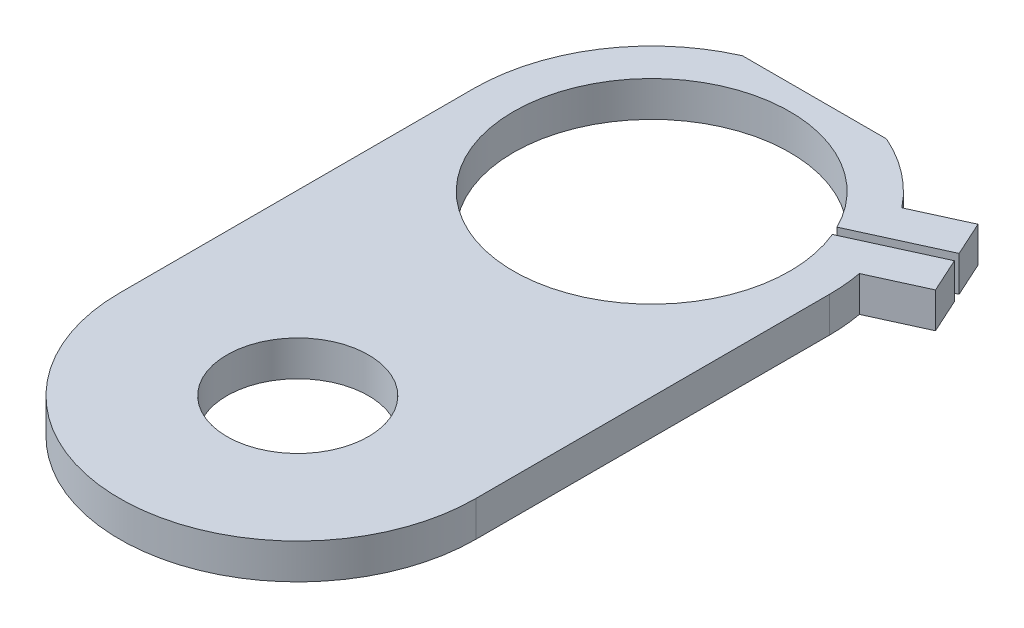
ISO-10303-21;
HEADER;
FILE_DESCRIPTION(('STEP AP214'),'2;1');
FILE_NAME('part.step','',(''),(''),'','','');
FILE_SCHEMA(('AUTOMOTIVE_DESIGN { 1 0 10303 214 1 1 1 1 }'));
ENDSEC;
DATA;
#1=APPLICATION_CONTEXT('core data for automotive mechanical design processes');
#2=APPLICATION_PROTOCOL_DEFINITION('international standard','automotive_design',2000,#1);
#3=PRODUCT_CONTEXT('',#1,'mechanical');
#4=PRODUCT('Part','Part','',(#3));
#5=PRODUCT_RELATED_PRODUCT_CATEGORY('part','',(#4));
#6=PRODUCT_DEFINITION_FORMATION('','',#4);
#7=PRODUCT_DEFINITION_CONTEXT('part definition',#1,'design');
#8=PRODUCT_DEFINITION('design','',#6,#7);
#9=PRODUCT_DEFINITION_SHAPE('','',#8);
#10=(LENGTH_UNIT() NAMED_UNIT(*) SI_UNIT(.MILLI.,.METRE.));
#11=(NAMED_UNIT(*) PLANE_ANGLE_UNIT() SI_UNIT($,.RADIAN.));
#12=(NAMED_UNIT(*) SI_UNIT($,.STERADIAN.) SOLID_ANGLE_UNIT());
#13=UNCERTAINTY_MEASURE_WITH_UNIT(LENGTH_MEASURE(1.E-05),#10,'distance_accuracy_value','');
#14=(GEOMETRIC_REPRESENTATION_CONTEXT(3) GLOBAL_UNCERTAINTY_ASSIGNED_CONTEXT((#13)) GLOBAL_UNIT_ASSIGNED_CONTEXT((#10,
#11,#12)) REPRESENTATION_CONTEXT('',''));
#15=CARTESIAN_POINT('',(0.,0.,0.));
#16=DIRECTION('',(0.,0.,1.));
#17=DIRECTION('',(1.,0.,0.));
#18=AXIS2_PLACEMENT_3D('',#15,#16,#17);
#19=CARTESIAN_POINT('',(0.,0.,0.));
#20=DIRECTION('',(0.,1.,0.));
#21=DIRECTION('',(0.,0.,1.));
#22=AXIS2_PLACEMENT_3D('',#19,#20,#21);
#23=PLANE('',#22);
#24=CARTESIAN_POINT('',(-44.45,0.,41.3113329753969));
#25=DIRECTION('',(0.,1.,0.));
#26=DIRECTION('',(0.,0.,1.));
#27=AXIS2_PLACEMENT_3D('',#24,#25,#26);
#28=CIRCLE('',#27,3.175);
#29=CARTESIAN_POINT('',(-44.45,0.,44.4863329753969));
#30=VERTEX_POINT('',#29);
#31=EDGE_CURVE('E322',#30,#30,#28,.T.);
#32=ORIENTED_EDGE('',*,*,#31,.T.);
#33=EDGE_LOOP('',(#32));
#34=FACE_BOUND('',#33,.T.);
#35=CARTESIAN_POINT('',(-44.45,0.,127.));
#36=DIRECTION('',(0.,1.,0.));
#37=DIRECTION('',(0.,0.,1.));
#38=AXIS2_PLACEMENT_3D('',#35,#36,#37);
#39=CIRCLE('',#38,3.175);
#40=CARTESIAN_POINT('',(-44.45,0.,130.175));
#41=VERTEX_POINT('',#40);
#42=EDGE_CURVE('E303',#41,#41,#39,.T.);
#43=ORIENTED_EDGE('',*,*,#42,.T.);
#44=EDGE_LOOP('',(#43));
#45=FACE_BOUND('',#44,.T.);
#46=CARTESIAN_POINT('',(44.45,0.,127.));
#47=DIRECTION('',(0.,1.,0.));
#48=DIRECTION('',(0.,0.,1.));
#49=AXIS2_PLACEMENT_3D('',#46,#47,#48);
#50=CIRCLE('',#49,3.175);
#51=CARTESIAN_POINT('',(44.45,0.,130.175));
#52=VERTEX_POINT('',#51);
#53=EDGE_CURVE('E314',#52,#52,#50,.T.);
#54=ORIENTED_EDGE('',*,*,#53,.T.);
#55=EDGE_LOOP('',(#54));
#56=FACE_BOUND('',#55,.T.);
#57=CARTESIAN_POINT('',(0.,0.,127.));
#58=DIRECTION('',(0.,1.,0.));
#59=DIRECTION('',(0.,0.,1.));
#60=AXIS2_PLACEMENT_3D('',#57,#58,#59);
#61=CIRCLE('',#60,25.4);
#62=CARTESIAN_POINT('',(0.,0.,152.4));
#63=VERTEX_POINT('',#62);
#64=EDGE_CURVE('E298',#63,#63,#61,.T.);
#65=ORIENTED_EDGE('',*,*,#64,.T.);
#66=EDGE_LOOP('',(#65));
#67=FACE_BOUND('',#66,.T.);
#68=CARTESIAN_POINT('',(0.,0.,0.));
#69=DIRECTION('',(0.,1.,0.));
#70=DIRECTION('',(0.,0.,1.));
#71=AXIS2_PLACEMENT_3D('',#68,#69,#70);
#72=CIRCLE('',#71,49.5875364217784);
#73=CARTESIAN_POINT('',(44.3704280468253,0.,-22.1402096494749));
#74=VERTEX_POINT('',#73);
#75=CARTESIAN_POINT('',(45.7963528226343,0.,-19.0162519053045));
#76=VERTEX_POINT('',#75);
#77=EDGE_CURVE('E52',#74,#76,#72,.T.);
#78=ORIENTED_EDGE('',*,*,#77,.T.);
#79=DIRECTION('',(-0.909713288386591,0.,0.415236959979306));
#80=VECTOR('',#79,1.);
#81=CARTESIAN_POINT('',(75.8713050969462,0.,-32.7439086443375));
#82=LINE('',#81,#80);
#83=CARTESIAN_POINT('',(75.8713050969462,0.,-32.7439086443375));
#84=VERTEX_POINT('',#83);
#85=EDGE_CURVE('E187',#84,#76,#82,.T.);
#86=ORIENTED_EDGE('',*,*,#85,.F.);
#87=DIRECTION('',(-0.415236959979306,0.,-0.90971328838659));
#88=VECTOR('',#87,1.);
#89=CARTESIAN_POINT('',(81.5560801827155,0.,-20.2895369591411));
#90=LINE('',#89,#88);
#91=CARTESIAN_POINT('',(81.5560801827155,0.,-20.2895369591411));
#92=VERTEX_POINT('',#91);
#93=EDGE_CURVE('E184',#92,#84,#90,.T.);
#94=ORIENTED_EDGE('',*,*,#93,.F.);
#95=DIRECTION('',(0.90971328838659,0.,-0.415236959979306));
#96=VECTOR('',#95,1.);
#97=CARTESIAN_POINT('',(62.7955082286804,0.,-11.7263083407238));
#98=LINE('',#97,#96);
#99=CARTESIAN_POINT('',(62.7955082286804,0.,-11.7263083407238));
#100=VERTEX_POINT('',#99);
#101=EDGE_CURVE('E180',#100,#92,#98,.T.);
#102=ORIENTED_EDGE('',*,*,#101,.F.);
#103=CARTESIAN_POINT('',(0.,0.,0.));
#104=DIRECTION('',(0.,1.,0.));
#105=DIRECTION('',(0.,0.,1.));
#106=AXIS2_PLACEMENT_3D('',#103,#104,#105);
#107=CIRCLE('',#106,63.881);
#108=CARTESIAN_POINT('',(63.881,0.,0.));
#109=VERTEX_POINT('',#108);
#110=EDGE_CURVE('E176',#109,#100,#107,.T.);
#111=ORIENTED_EDGE('',*,*,#110,.F.);
#112=DIRECTION('',(0.,0.,-1.));
#113=VECTOR('',#112,1.);
#114=CARTESIAN_POINT('',(63.881,0.,0.));
#115=LINE('',#114,#113);
#116=CARTESIAN_POINT('',(63.881,0.,127.));
#117=VERTEX_POINT('',#116);
#118=EDGE_CURVE('E106',#117,#109,#115,.T.);
#119=ORIENTED_EDGE('',*,*,#118,.F.);
#120=CARTESIAN_POINT('',(0.,0.,127.));
#121=DIRECTION('',(0.,1.,0.));
#122=DIRECTION('',(0.,0.,1.));
#123=AXIS2_PLACEMENT_3D('',#120,#121,#122);
#124=CIRCLE('',#123,63.881);
#125=CARTESIAN_POINT('',(-63.881,0.,127.));
#126=VERTEX_POINT('',#125);
#127=EDGE_CURVE('E212',#126,#117,#124,.T.);
#128=ORIENTED_EDGE('',*,*,#127,.F.);
#129=DIRECTION('',(0.,0.,1.));
#130=VECTOR('',#129,1.);
#131=CARTESIAN_POINT('',(-63.881,0.,0.));
#132=LINE('',#131,#130);
#133=CARTESIAN_POINT('',(-63.881,0.,0.));
#134=VERTEX_POINT('',#133);
#135=EDGE_CURVE('E160',#134,#126,#132,.T.);
#136=ORIENTED_EDGE('',*,*,#135,.F.);
#137=CARTESIAN_POINT('',(0.,0.,0.));
#138=DIRECTION('',(0.,1.,0.));
#139=DIRECTION('',(0.,0.,1.));
#140=AXIS2_PLACEMENT_3D('',#137,#138,#139);
#141=CIRCLE('',#140,63.881);
#142=CARTESIAN_POINT('',(-25.8434858523381,0.,-58.42));
#143=VERTEX_POINT('',#142);
#144=EDGE_CURVE('E207',#143,#134,#141,.T.);
#145=ORIENTED_EDGE('',*,*,#144,.F.);
#146=DIRECTION('',(-1.,0.,0.));
#147=VECTOR('',#146,1.);
#148=CARTESIAN_POINT('',(0.,0.,-58.42));
#149=LINE('',#148,#147);
#150=CARTESIAN_POINT('',(25.8434858523381,0.,-58.42));
#151=VERTEX_POINT('',#150);
#152=EDGE_CURVE('E204',#151,#143,#149,.T.);
#153=ORIENTED_EDGE('',*,*,#152,.F.);
#154=CARTESIAN_POINT('',(0.,0.,0.));
#155=DIRECTION('',(0.,1.,0.));
#156=DIRECTION('',(0.,0.,1.));
#157=AXIS2_PLACEMENT_3D('',#154,#155,#156);
#158=CIRCLE('',#157,63.881);
#159=CARTESIAN_POINT('',(50.000033281333,0.,-39.7590094552869));
#160=VERTEX_POINT('',#159);
#161=EDGE_CURVE('E200',#160,#151,#158,.T.);
#162=ORIENTED_EDGE('',*,*,#161,.F.);
#163=DIRECTION('',(-0.909713288386591,0.,0.415236959979306));
#164=VECTOR('',#163,1.);
#165=CARTESIAN_POINT('',(50.000033281333,0.,-39.7590094552869));
#166=LINE('',#165,#164);
#167=CARTESIAN_POINT('',(68.760605235368,0.,-48.3222380737042));
#168=VERTEX_POINT('',#167);
#169=EDGE_CURVE('E197',#168,#160,#166,.T.);
#170=ORIENTED_EDGE('',*,*,#169,.F.);
#171=DIRECTION('',(-0.415236959979306,0.,-0.909713288386591));
#172=VECTOR('',#171,1.);
#173=CARTESIAN_POINT('',(74.4453803211373,0.,-35.8678663885078));
#174=LINE('',#173,#172);
#175=CARTESIAN_POINT('',(74.4453803211373,0.,-35.8678663885078));
#176=VERTEX_POINT('',#175);
#177=EDGE_CURVE('E194',#176,#168,#174,.T.);
#178=ORIENTED_EDGE('',*,*,#177,.F.);
#179=DIRECTION('',(0.909713288386591,0.,-0.415236959979306));
#180=VECTOR('',#179,1.);
#181=CARTESIAN_POINT('',(74.4453803211373,0.,-35.8678663885078));
#182=LINE('',#181,#180);
#183=EDGE_CURVE('E191',#74,#176,#182,.T.);
#184=ORIENTED_EDGE('',*,*,#183,.F.);
#185=EDGE_LOOP('',(#78,#86,#94,#102,#111,#119,#128,#136,#145,#153,#162,#170,#178,#184));
#186=FACE_BOUND('',#185,.T.);
#187=CARTESIAN_POINT('',(0.,0.,171.45));
#188=DIRECTION('',(0.,1.,0.));
#189=DIRECTION('',(0.,0.,1.));
#190=AXIS2_PLACEMENT_3D('',#187,#188,#189);
#191=CIRCLE('',#190,3.17500000000001);
#192=CARTESIAN_POINT('',(0.,0.,174.625));
#193=VERTEX_POINT('',#192);
#194=EDGE_CURVE('E311',#193,#193,#191,.T.);
#195=ORIENTED_EDGE('',*,*,#194,.T.);
#196=EDGE_LOOP('',(#195));
#197=FACE_BOUND('',#196,.T.);
#198=CARTESIAN_POINT('',(0.,0.,82.55));
#199=DIRECTION('',(0.,1.,0.));
#200=DIRECTION('',(0.,0.,1.));
#201=AXIS2_PLACEMENT_3D('',#198,#199,#200);
#202=CIRCLE('',#201,3.175);
#203=CARTESIAN_POINT('',(0.,0.,85.725));
#204=VERTEX_POINT('',#203);
#205=EDGE_CURVE('E304',#204,#204,#202,.T.);
#206=ORIENTED_EDGE('',*,*,#205,.T.);
#207=EDGE_LOOP('',(#206));
#208=FACE_BOUND('',#207,.T.);
#209=CARTESIAN_POINT('',(44.45,0.,45.3064469575111));
#210=DIRECTION('',(0.,1.,0.));
#211=DIRECTION('',(0.,0.,1.));
#212=AXIS2_PLACEMENT_3D('',#209,#210,#211);
#213=CIRCLE('',#212,3.175);
#214=CARTESIAN_POINT('',(44.45,0.,48.4814469575111));
#215=VERTEX_POINT('',#214);
#216=EDGE_CURVE('E323',#215,#215,#213,.T.);
#217=ORIENTED_EDGE('',*,*,#216,.T.);
#218=EDGE_LOOP('',(#217));
#219=FACE_BOUND('',#218,.T.);
#220=ADVANCED_FACE('F37',(#34,#45,#56,#67,#186,#197,#208,#219),#23,.F.);
#221=CARTESIAN_POINT('',(0.,12.7,0.));
#222=DIRECTION('',(0.,1.,0.));
#223=DIRECTION('',(0.,0.,1.));
#224=AXIS2_PLACEMENT_3D('',#221,#222,#223);
#225=PLANE('',#224);
#226=CARTESIAN_POINT('',(0.,12.7,127.));
#227=DIRECTION('',(0.,1.,0.));
#228=DIRECTION('',(0.,0.,1.));
#229=AXIS2_PLACEMENT_3D('',#226,#227,#228);
#230=CIRCLE('',#229,25.4);
#231=CARTESIAN_POINT('',(0.,12.7,152.4));
#232=VERTEX_POINT('',#231);
#233=EDGE_CURVE('E181',#232,#232,#230,.T.);
#234=ORIENTED_EDGE('',*,*,#233,.F.);
#235=EDGE_LOOP('',(#234));
#236=FACE_BOUND('',#235,.T.);
#237=DIRECTION('',(-0.909713288386591,0.,0.415236959979306));
#238=VECTOR('',#237,1.);
#239=CARTESIAN_POINT('',(75.8713050969462,12.7,-32.7439086443375));
#240=LINE('',#239,#238);
#241=CARTESIAN_POINT('',(75.8713050969462,12.7,-32.7439086443375));
#242=VERTEX_POINT('',#241);
#243=CARTESIAN_POINT('',(45.7963528226343,12.7,-19.0162519053045));
#244=VERTEX_POINT('',#243);
#245=EDGE_CURVE('E270',#242,#244,#240,.T.);
#246=ORIENTED_EDGE('',*,*,#245,.T.);
#247=CARTESIAN_POINT('',(0.,12.7,0.));
#248=DIRECTION('',(0.,1.,0.));
#249=DIRECTION('',(0.,0.,1.));
#250=AXIS2_PLACEMENT_3D('',#247,#248,#249);
#251=CIRCLE('',#250,49.5875364217784);
#252=CARTESIAN_POINT('',(44.3704280468253,12.7,-22.1402096494749));
#253=VERTEX_POINT('',#252);
#254=EDGE_CURVE('E326',#253,#244,#251,.T.);
#255=ORIENTED_EDGE('',*,*,#254,.F.);
#256=DIRECTION('',(0.909713288386591,0.,-0.415236959979306));
#257=VECTOR('',#256,1.);
#258=CARTESIAN_POINT('',(74.4453803211373,12.7,-35.8678663885078));
#259=LINE('',#258,#257);
#260=CARTESIAN_POINT('',(74.4453803211373,12.7,-35.8678663885078));
#261=VERTEX_POINT('',#260);
#262=EDGE_CURVE('E275',#253,#261,#259,.T.);
#263=ORIENTED_EDGE('',*,*,#262,.T.);
#264=DIRECTION('',(-0.415236959979306,0.,-0.909713288386591));
#265=VECTOR('',#264,1.);
#266=CARTESIAN_POINT('',(74.4453803211373,12.7,-35.8678663885078));
#267=LINE('',#266,#265);
#268=CARTESIAN_POINT('',(68.760605235368,12.7,-48.3222380737042));
#269=VERTEX_POINT('',#268);
#270=EDGE_CURVE('E280',#261,#269,#267,.T.);
#271=ORIENTED_EDGE('',*,*,#270,.T.);
#272=DIRECTION('',(-0.909713288386591,0.,0.415236959979306));
#273=VECTOR('',#272,1.);
#274=CARTESIAN_POINT('',(50.000033281333,12.7,-39.7590094552869));
#275=LINE('',#274,#273);
#276=CARTESIAN_POINT('',(50.000033281333,12.7,-39.7590094552869));
#277=VERTEX_POINT('',#276);
#278=EDGE_CURVE('E288',#269,#277,#275,.T.);
#279=ORIENTED_EDGE('',*,*,#278,.T.);
#280=CARTESIAN_POINT('',(0.,12.7,0.));
#281=DIRECTION('',(0.,1.,0.));
#282=DIRECTION('',(0.,0.,1.));
#283=AXIS2_PLACEMENT_3D('',#280,#281,#282);
#284=CIRCLE('',#283,63.881);
#285=CARTESIAN_POINT('',(25.8434858523381,12.7,-58.42));
#286=VERTEX_POINT('',#285);
#287=EDGE_CURVE('E291',#277,#286,#284,.T.);
#288=ORIENTED_EDGE('',*,*,#287,.T.);
#289=DIRECTION('',(-1.,0.,0.));
#290=VECTOR('',#289,1.);
#291=CARTESIAN_POINT('',(0.,12.7,-58.42));
#292=LINE('',#291,#290);
#293=CARTESIAN_POINT('',(-25.8434858523381,12.7,-58.42));
#294=VERTEX_POINT('',#293);
#295=EDGE_CURVE('E294',#286,#294,#292,.T.);
#296=ORIENTED_EDGE('',*,*,#295,.T.);
#297=CARTESIAN_POINT('',(0.,12.7,0.));
#298=DIRECTION('',(0.,1.,0.));
#299=DIRECTION('',(0.,0.,1.));
#300=AXIS2_PLACEMENT_3D('',#297,#298,#299);
#301=CIRCLE('',#300,63.881);
#302=CARTESIAN_POINT('',(-63.881,12.7,0.));
#303=VERTEX_POINT('',#302);
#304=EDGE_CURVE('E150',#294,#303,#301,.T.);
#305=ORIENTED_EDGE('',*,*,#304,.T.);
#306=DIRECTION('',(0.,0.,1.));
#307=VECTOR('',#306,1.);
#308=CARTESIAN_POINT('',(-63.881,12.7,0.));
#309=LINE('',#308,#307);
#310=CARTESIAN_POINT('',(-63.881,12.7,127.));
#311=VERTEX_POINT('',#310);
#312=EDGE_CURVE('E142',#303,#311,#309,.T.);
#313=ORIENTED_EDGE('',*,*,#312,.T.);
#314=CARTESIAN_POINT('',(0.,12.7,127.));
#315=DIRECTION('',(0.,1.,0.));
#316=DIRECTION('',(0.,0.,1.));
#317=AXIS2_PLACEMENT_3D('',#314,#315,#316);
#318=CIRCLE('',#317,63.881);
#319=CARTESIAN_POINT('',(63.881,12.7,127.));
#320=VERTEX_POINT('',#319);
#321=EDGE_CURVE('E147',#311,#320,#318,.T.);
#322=ORIENTED_EDGE('',*,*,#321,.T.);
#323=DIRECTION('',(0.,0.,-1.));
#324=VECTOR('',#323,1.);
#325=CARTESIAN_POINT('',(63.881,12.7,0.));
#326=LINE('',#325,#324);
#327=CARTESIAN_POINT('',(63.881,12.7,0.));
#328=VERTEX_POINT('',#327);
#329=EDGE_CURVE('E61',#320,#328,#326,.T.);
#330=ORIENTED_EDGE('',*,*,#329,.T.);
#331=CARTESIAN_POINT('',(0.,12.7,0.));
#332=DIRECTION('',(0.,1.,0.));
#333=DIRECTION('',(0.,0.,1.));
#334=AXIS2_PLACEMENT_3D('',#331,#332,#333);
#335=CIRCLE('',#334,63.881);
#336=CARTESIAN_POINT('',(62.7955082286804,12.7,-11.7263083407238));
#337=VERTEX_POINT('',#336);
#338=EDGE_CURVE('E217',#328,#337,#335,.T.);
#339=ORIENTED_EDGE('',*,*,#338,.T.);
#340=DIRECTION('',(0.90971328838659,0.,-0.415236959979306));
#341=VECTOR('',#340,1.);
#342=CARTESIAN_POINT('',(62.7955082286804,12.7,-11.7263083407238));
#343=LINE('',#342,#341);
#344=CARTESIAN_POINT('',(81.5560801827155,12.7,-20.2895369591411));
#345=VERTEX_POINT('',#344);
#346=EDGE_CURVE('E115',#337,#345,#343,.T.);
#347=ORIENTED_EDGE('',*,*,#346,.T.);
#348=DIRECTION('',(-0.415236959979306,0.,-0.90971328838659));
#349=VECTOR('',#348,1.);
#350=CARTESIAN_POINT('',(81.5560801827155,12.7,-20.2895369591411));
#351=LINE('',#350,#349);
#352=EDGE_CURVE('E276',#345,#242,#351,.T.);
#353=ORIENTED_EDGE('',*,*,#352,.T.);
#354=EDGE_LOOP('',(#246,#255,#263,#271,#279,#288,#296,#305,#313,#322,#330,#339,#347,#353));
#355=FACE_BOUND('',#354,.T.);
#356=ADVANCED_FACE('F145',(#236,#355),#225,.T.);
#357=CARTESIAN_POINT('',(75.8713050969462,12.7,-32.7439086443375));
#358=DIRECTION('',(0.415236959979306,0.,0.909713288386591));
#359=DIRECTION('',(0.909713288386591,0.,-0.415236959979306));
#360=AXIS2_PLACEMENT_3D('',#357,#358,#359);
#361=PLANE('',#360);
#362=DIRECTION('',(0.,-1.,0.));
#363=VECTOR('',#362,1.);
#364=CARTESIAN_POINT('',(45.7963528226343,152.954733064698,-19.0162519053045));
#365=LINE('',#364,#363);
#366=EDGE_CURVE('E272',#244,#76,#365,.T.);
#367=ORIENTED_EDGE('',*,*,#366,.F.);
#368=ORIENTED_EDGE('',*,*,#245,.F.);
#369=DIRECTION('',(0.,-1.,0.));
#370=VECTOR('',#369,1.);
#371=CARTESIAN_POINT('',(75.8713050969462,12.7,-32.7439086443375));
#372=LINE('',#371,#370);
#373=EDGE_CURVE('E244',#242,#84,#372,.T.);
#374=ORIENTED_EDGE('',*,*,#373,.T.);
#375=ORIENTED_EDGE('',*,*,#85,.T.);
#376=EDGE_LOOP('',(#367,#368,#374,#375));
#377=FACE_BOUND('',#376,.T.);
#378=ADVANCED_FACE('F269',(#377),#361,.F.);
#379=CARTESIAN_POINT('',(74.4453803211373,12.7,-35.8678663885078));
#380=DIRECTION('',(-0.415236959979306,0.,-0.909713288386591));
#381=DIRECTION('',(-0.909713288386591,0.,0.415236959979306));
#382=AXIS2_PLACEMENT_3D('',#379,#380,#381);
#383=PLANE('',#382);
#384=DIRECTION('',(0.,-1.,0.));
#385=VECTOR('',#384,1.);
#386=CARTESIAN_POINT('',(44.3704280468253,152.954733064698,-22.1402096494749));
#387=LINE('',#386,#385);
#388=EDGE_CURVE('E11',#74,#253,#387,.F.);
#389=ORIENTED_EDGE('',*,*,#388,.F.);
#390=ORIENTED_EDGE('',*,*,#183,.T.);
#391=DIRECTION('',(0.,-1.,0.));
#392=VECTOR('',#391,1.);
#393=CARTESIAN_POINT('',(74.4453803211373,12.7,-35.8678663885078));
#394=LINE('',#393,#392);
#395=EDGE_CURVE('E240',#261,#176,#394,.T.);
#396=ORIENTED_EDGE('',*,*,#395,.F.);
#397=ORIENTED_EDGE('',*,*,#262,.F.);
#398=EDGE_LOOP('',(#389,#390,#396,#397));
#399=FACE_BOUND('',#398,.T.);
#400=ADVANCED_FACE('F413',(#399),#383,.F.);
#401=CARTESIAN_POINT('',(0.,12.7,0.));
#402=DIRECTION('',(0.,-1.,0.));
#403=DIRECTION('',(0.,0.,-1.));
#404=AXIS2_PLACEMENT_3D('',#401,#402,#403);
#405=CYLINDRICAL_SURFACE('',#404,63.881);
#406=ORIENTED_EDGE('',*,*,#110,.T.);
#407=DIRECTION('',(0.,-1.,0.));
#408=VECTOR('',#407,1.);
#409=CARTESIAN_POINT('',(62.7955082286804,12.7,-11.7263083407238));
#410=LINE('',#409,#408);
#411=EDGE_CURVE('E46',#337,#100,#410,.T.);
#412=ORIENTED_EDGE('',*,*,#411,.F.);
#413=ORIENTED_EDGE('',*,*,#338,.F.);
#414=DIRECTION('',(0.,-1.,0.));
#415=VECTOR('',#414,1.);
#416=CARTESIAN_POINT('',(63.881,12.7,0.));
#417=LINE('',#416,#415);
#418=EDGE_CURVE('E172',#328,#109,#417,.T.);
#419=ORIENTED_EDGE('',*,*,#418,.T.);
#420=EDGE_LOOP('',(#406,#412,#413,#419));
#421=FACE_BOUND('',#420,.T.);
#422=ADVANCED_FACE('F39',(#421),#405,.T.);
#423=CARTESIAN_POINT('',(62.7955082286804,12.7,-11.7263083407238));
#424=DIRECTION('',(-0.415236959979306,0.,-0.90971328838659));
#425=DIRECTION('',(-0.90971328838659,0.,0.415236959979306));
#426=AXIS2_PLACEMENT_3D('',#423,#424,#425);
#427=PLANE('',#426);
#428=ORIENTED_EDGE('',*,*,#101,.T.);
#429=DIRECTION('',(0.,-1.,0.));
#430=VECTOR('',#429,1.);
#431=CARTESIAN_POINT('',(81.5560801827155,12.7,-20.2895369591411));
#432=LINE('',#431,#430);
#433=EDGE_CURVE('E248',#345,#92,#432,.T.);
#434=ORIENTED_EDGE('',*,*,#433,.F.);
#435=ORIENTED_EDGE('',*,*,#346,.F.);
#436=ORIENTED_EDGE('',*,*,#411,.T.);
#437=EDGE_LOOP('',(#428,#434,#435,#436));
#438=FACE_BOUND('',#437,.T.);
#439=ADVANCED_FACE('F254',(#438),#427,.F.);
#440=CARTESIAN_POINT('',(81.5560801827155,12.7,-20.2895369591411));
#441=DIRECTION('',(-0.90971328838659,0.,0.415236959979306));
#442=DIRECTION('',(0.415236959979306,0.,0.909713288386591));
#443=AXIS2_PLACEMENT_3D('',#440,#441,#442);
#444=PLANE('',#443);
#445=ORIENTED_EDGE('',*,*,#93,.T.);
#446=ORIENTED_EDGE('',*,*,#373,.F.);
#447=ORIENTED_EDGE('',*,*,#352,.F.);
#448=ORIENTED_EDGE('',*,*,#433,.T.);
#449=EDGE_LOOP('',(#445,#446,#447,#448));
#450=FACE_BOUND('',#449,.T.);
#451=ADVANCED_FACE('F264',(#450),#444,.F.);
#452=CARTESIAN_POINT('',(74.4453803211373,12.7,-35.8678663885078));
#453=DIRECTION('',(-0.909713288386591,0.,0.415236959979306));
#454=DIRECTION('',(0.415236959979306,0.,0.909713288386591));
#455=AXIS2_PLACEMENT_3D('',#452,#453,#454);
#456=PLANE('',#455);
#457=ORIENTED_EDGE('',*,*,#177,.T.);
#458=DIRECTION('',(0.,-1.,0.));
#459=VECTOR('',#458,1.);
#460=CARTESIAN_POINT('',(68.760605235368,12.7,-48.3222380737042));
#461=LINE('',#460,#459);
#462=EDGE_CURVE('E236',#269,#168,#461,.T.);
#463=ORIENTED_EDGE('',*,*,#462,.F.);
#464=ORIENTED_EDGE('',*,*,#270,.F.);
#465=ORIENTED_EDGE('',*,*,#395,.T.);
#466=EDGE_LOOP('',(#457,#463,#464,#465));
#467=FACE_BOUND('',#466,.T.);
#468=ADVANCED_FACE('F408',(#467),#456,.F.);
#469=CARTESIAN_POINT('',(50.000033281333,12.7,-39.7590094552869));
#470=DIRECTION('',(0.415236959979306,0.,0.90971328838659));
#471=DIRECTION('',(0.909713288386591,0.,-0.415236959979306));
#472=AXIS2_PLACEMENT_3D('',#469,#470,#471);
#473=PLANE('',#472);
#474=ORIENTED_EDGE('',*,*,#169,.T.);
#475=DIRECTION('',(0.,-1.,0.));
#476=VECTOR('',#475,1.);
#477=CARTESIAN_POINT('',(50.000033281333,12.7,-39.7590094552869));
#478=LINE('',#477,#476);
#479=EDGE_CURVE('E232',#277,#160,#478,.T.);
#480=ORIENTED_EDGE('',*,*,#479,.F.);
#481=ORIENTED_EDGE('',*,*,#278,.F.);
#482=ORIENTED_EDGE('',*,*,#462,.T.);
#483=EDGE_LOOP('',(#474,#480,#481,#482));
#484=FACE_BOUND('',#483,.T.);
#485=ADVANCED_FACE('F404',(#484),#473,.F.);
#486=CARTESIAN_POINT('',(0.,12.7,0.));
#487=DIRECTION('',(0.,-1.,0.));
#488=DIRECTION('',(0.,0.,-1.));
#489=AXIS2_PLACEMENT_3D('',#486,#487,#488);
#490=CYLINDRICAL_SURFACE('',#489,63.881);
#491=ORIENTED_EDGE('',*,*,#161,.T.);
#492=DIRECTION('',(0.,-1.,0.));
#493=VECTOR('',#492,1.);
#494=CARTESIAN_POINT('',(25.8434858523381,12.7,-58.42));
#495=LINE('',#494,#493);
#496=EDGE_CURVE('E228',#286,#151,#495,.T.);
#497=ORIENTED_EDGE('',*,*,#496,.F.);
#498=ORIENTED_EDGE('',*,*,#287,.F.);
#499=ORIENTED_EDGE('',*,*,#479,.T.);
#500=EDGE_LOOP('',(#491,#497,#498,#499));
#501=FACE_BOUND('',#500,.T.);
#502=ADVANCED_FACE('F400',(#501),#490,.T.);
#503=CARTESIAN_POINT('',(0.,12.7,-58.42));
#504=DIRECTION('',(0.,0.,1.));
#505=DIRECTION('',(1.,0.,0.));
#506=AXIS2_PLACEMENT_3D('',#503,#504,#505);
#507=PLANE('',#506);
#508=ORIENTED_EDGE('',*,*,#152,.T.);
#509=DIRECTION('',(0.,-1.,0.));
#510=VECTOR('',#509,1.);
#511=CARTESIAN_POINT('',(-25.8434858523381,12.7,-58.42));
#512=LINE('',#511,#510);
#513=EDGE_CURVE('E224',#294,#143,#512,.T.);
#514=ORIENTED_EDGE('',*,*,#513,.F.);
#515=ORIENTED_EDGE('',*,*,#295,.F.);
#516=ORIENTED_EDGE('',*,*,#496,.T.);
#517=EDGE_LOOP('',(#508,#514,#515,#516));
#518=FACE_BOUND('',#517,.T.);
#519=ADVANCED_FACE('F396',(#518),#507,.F.);
#520=CARTESIAN_POINT('',(0.,12.7,0.));
#521=DIRECTION('',(0.,-1.,0.));
#522=DIRECTION('',(0.,0.,-1.));
#523=AXIS2_PLACEMENT_3D('',#520,#521,#522);
#524=CYLINDRICAL_SURFACE('',#523,63.881);
#525=ORIENTED_EDGE('',*,*,#144,.T.);
#526=DIRECTION('',(0.,-1.,0.));
#527=VECTOR('',#526,1.);
#528=CARTESIAN_POINT('',(-63.881,12.7,0.));
#529=LINE('',#528,#527);
#530=EDGE_CURVE('E164',#303,#134,#529,.T.);
#531=ORIENTED_EDGE('',*,*,#530,.F.);
#532=ORIENTED_EDGE('',*,*,#304,.F.);
#533=ORIENTED_EDGE('',*,*,#513,.T.);
#534=EDGE_LOOP('',(#525,#531,#532,#533));
#535=FACE_BOUND('',#534,.T.);
#536=ADVANCED_FACE('F393',(#535),#524,.T.);
#537=CARTESIAN_POINT('',(-63.881,12.7,0.));
#538=DIRECTION('',(1.,0.,0.));
#539=DIRECTION('',(0.,0.,-1.));
#540=AXIS2_PLACEMENT_3D('',#537,#538,#539);
#541=PLANE('',#540);
#542=ORIENTED_EDGE('',*,*,#135,.T.);
#543=DIRECTION('',(0.,-1.,0.));
#544=VECTOR('',#543,1.);
#545=CARTESIAN_POINT('',(-63.881,12.7,127.));
#546=LINE('',#545,#544);
#547=EDGE_CURVE('E157',#311,#126,#546,.T.);
#548=ORIENTED_EDGE('',*,*,#547,.F.);
#549=ORIENTED_EDGE('',*,*,#312,.F.);
#550=ORIENTED_EDGE('',*,*,#530,.T.);
#551=EDGE_LOOP('',(#542,#548,#549,#550));
#552=FACE_BOUND('',#551,.T.);
#553=ADVANCED_FACE('F158',(#552),#541,.F.);
#554=CARTESIAN_POINT('',(0.,12.7,127.));
#555=DIRECTION('',(0.,-1.,0.));
#556=DIRECTION('',(0.,0.,-1.));
#557=AXIS2_PLACEMENT_3D('',#554,#555,#556);
#558=CYLINDRICAL_SURFACE('',#557,63.881);
#559=ORIENTED_EDGE('',*,*,#127,.T.);
#560=DIRECTION('',(0.,-1.,0.));
#561=VECTOR('',#560,1.);
#562=CARTESIAN_POINT('',(63.881,12.7,127.));
#563=LINE('',#562,#561);
#564=EDGE_CURVE('E165',#320,#117,#563,.T.);
#565=ORIENTED_EDGE('',*,*,#564,.F.);
#566=ORIENTED_EDGE('',*,*,#321,.F.);
#567=ORIENTED_EDGE('',*,*,#547,.T.);
#568=EDGE_LOOP('',(#559,#565,#566,#567));
#569=FACE_BOUND('',#568,.T.);
#570=ADVANCED_FACE('F167',(#569),#558,.T.);
#571=CARTESIAN_POINT('',(63.881,12.7,0.));
#572=DIRECTION('',(-1.,0.,0.));
#573=DIRECTION('',(0.,0.,1.));
#574=AXIS2_PLACEMENT_3D('',#571,#572,#573);
#575=PLANE('',#574);
#576=ORIENTED_EDGE('',*,*,#118,.T.);
#577=ORIENTED_EDGE('',*,*,#418,.F.);
#578=ORIENTED_EDGE('',*,*,#329,.F.);
#579=ORIENTED_EDGE('',*,*,#564,.T.);
#580=EDGE_LOOP('',(#576,#577,#578,#579));
#581=FACE_BOUND('',#580,.T.);
#582=ADVANCED_FACE('F385',(#581),#575,.F.);
#583=CARTESIAN_POINT('',(0.,12.7,127.));
#584=DIRECTION('',(0.,-1.,0.));
#585=DIRECTION('',(0.,0.,-1.));
#586=AXIS2_PLACEMENT_3D('',#583,#584,#585);
#587=CYLINDRICAL_SURFACE('',#586,25.4);
#588=ORIENTED_EDGE('',*,*,#233,.T.);
#589=EDGE_LOOP('',(#588));
#590=FACE_BOUND('',#589,.T.);
#591=ORIENTED_EDGE('',*,*,#64,.F.);
#592=EDGE_LOOP('',(#591));
#593=FACE_BOUND('',#592,.T.);
#594=ADVANCED_FACE('F388',(#590,#593),#587,.F.);
#595=CARTESIAN_POINT('',(0.,152.954733064698,0.));
#596=DIRECTION('',(0.,-1.,0.));
#597=DIRECTION('',(0.,0.,-1.));
#598=AXIS2_PLACEMENT_3D('',#595,#596,#597);
#599=CYLINDRICAL_SURFACE('',#598,49.5875364217784);
#600=ORIENTED_EDGE('',*,*,#366,.T.);
#601=ORIENTED_EDGE('',*,*,#77,.F.);
#602=ORIENTED_EDGE('',*,*,#388,.T.);
#603=ORIENTED_EDGE('',*,*,#254,.T.);
#604=EDGE_LOOP('',(#600,#601,#602,#603));
#605=FACE_BOUND('',#604,.T.);
#606=ADVANCED_FACE('F448',(#605),#599,.F.);
#607=CARTESIAN_POINT('',(44.45,6.35,127.));
#608=DIRECTION('',(0.,-1.,0.));
#609=DIRECTION('',(0.,0.,-1.));
#610=AXIS2_PLACEMENT_3D('',#607,#608,#609);
#611=CYLINDRICAL_SURFACE('',#610,3.175);
#612=CARTESIAN_POINT('',(44.45,6.35,127.));
#613=DIRECTION('',(0.,1.,0.));
#614=DIRECTION('',(0.,0.,1.));
#615=AXIS2_PLACEMENT_3D('',#612,#613,#614);
#616=CIRCLE('',#615,3.175);
#617=CARTESIAN_POINT('',(44.45,6.35,130.175));
#618=VERTEX_POINT('',#617);
#619=EDGE_CURVE('E332',#618,#618,#616,.T.);
#620=ORIENTED_EDGE('',*,*,#619,.T.);
#621=EDGE_LOOP('',(#620));
#622=FACE_BOUND('',#621,.T.);
#623=ORIENTED_EDGE('',*,*,#53,.F.);
#624=EDGE_LOOP('',(#623));
#625=FACE_BOUND('',#624,.T.);
#626=ADVANCED_FACE('F451',(#622,#625),#611,.F.);
#627=CARTESIAN_POINT('',(44.45,6.35,127.));
#628=DIRECTION('',(0.,1.,0.));
#629=DIRECTION('',(0.,0.,1.));
#630=AXIS2_PLACEMENT_3D('',#627,#628,#629);
#631=PLANE('',#630);
#632=ORIENTED_EDGE('',*,*,#619,.F.);
#633=EDGE_LOOP('',(#632));
#634=FACE_BOUND('',#633,.T.);
#635=ADVANCED_FACE('F456',(#634),#631,.F.);
#636=CARTESIAN_POINT('',(0.,6.35,171.45));
#637=DIRECTION('',(0.,-1.,0.));
#638=DIRECTION('',(0.,0.,-1.));
#639=AXIS2_PLACEMENT_3D('',#636,#637,#638);
#640=CYLINDRICAL_SURFACE('',#639,3.17500000000001);
#641=CARTESIAN_POINT('',(0.,6.35,171.45));
#642=DIRECTION('',(0.,1.,0.));
#643=DIRECTION('',(0.,0.,1.));
#644=AXIS2_PLACEMENT_3D('',#641,#642,#643);
#645=CIRCLE('',#644,3.17500000000001);
#646=CARTESIAN_POINT('',(0.,6.35,174.625));
#647=VERTEX_POINT('',#646);
#648=EDGE_CURVE('E309',#647,#647,#645,.T.);
#649=ORIENTED_EDGE('',*,*,#648,.T.);
#650=EDGE_LOOP('',(#649));
#651=FACE_BOUND('',#650,.T.);
#652=ORIENTED_EDGE('',*,*,#194,.F.);
#653=EDGE_LOOP('',(#652));
#654=FACE_BOUND('',#653,.T.);
#655=ADVANCED_FACE('F466',(#651,#654),#640,.F.);
#656=CARTESIAN_POINT('',(0.,6.35,171.45));
#657=DIRECTION('',(0.,1.,0.));
#658=DIRECTION('',(0.,0.,1.));
#659=AXIS2_PLACEMENT_3D('',#656,#657,#658);
#660=PLANE('',#659);
#661=ORIENTED_EDGE('',*,*,#648,.F.);
#662=EDGE_LOOP('',(#661));
#663=FACE_BOUND('',#662,.T.);
#664=ADVANCED_FACE('F476',(#663),#660,.F.);
#665=CARTESIAN_POINT('',(-44.45,6.35,127.));
#666=DIRECTION('',(0.,-1.,0.));
#667=DIRECTION('',(0.,0.,-1.));
#668=AXIS2_PLACEMENT_3D('',#665,#666,#667);
#669=CYLINDRICAL_SURFACE('',#668,3.175);
#670=CARTESIAN_POINT('',(-44.45,6.35,127.));
#671=DIRECTION('',(0.,1.,0.));
#672=DIRECTION('',(0.,0.,1.));
#673=AXIS2_PLACEMENT_3D('',#670,#671,#672);
#674=CIRCLE('',#673,3.175);
#675=CARTESIAN_POINT('',(-44.45,6.35,130.175));
#676=VERTEX_POINT('',#675);
#677=EDGE_CURVE('E301',#676,#676,#674,.T.);
#678=ORIENTED_EDGE('',*,*,#677,.T.);
#679=EDGE_LOOP('',(#678));
#680=FACE_BOUND('',#679,.T.);
#681=ORIENTED_EDGE('',*,*,#42,.F.);
#682=EDGE_LOOP('',(#681));
#683=FACE_BOUND('',#682,.T.);
#684=ADVANCED_FACE('F486',(#680,#683),#669,.F.);
#685=CARTESIAN_POINT('',(-44.45,6.35,127.));
#686=DIRECTION('',(0.,1.,0.));
#687=DIRECTION('',(0.,0.,1.));
#688=AXIS2_PLACEMENT_3D('',#685,#686,#687);
#689=PLANE('',#688);
#690=ORIENTED_EDGE('',*,*,#677,.F.);
#691=EDGE_LOOP('',(#690));
#692=FACE_BOUND('',#691,.T.);
#693=ADVANCED_FACE('F496',(#692),#689,.F.);
#694=CARTESIAN_POINT('',(0.,6.35,82.55));
#695=DIRECTION('',(0.,-1.,0.));
#696=DIRECTION('',(0.,0.,-1.));
#697=AXIS2_PLACEMENT_3D('',#694,#695,#696);
#698=CYLINDRICAL_SURFACE('',#697,3.175);
#699=CARTESIAN_POINT('',(0.,6.35,82.55));
#700=DIRECTION('',(0.,1.,0.));
#701=DIRECTION('',(0.,0.,1.));
#702=AXIS2_PLACEMENT_3D('',#699,#700,#701);
#703=CIRCLE('',#702,3.175);
#704=CARTESIAN_POINT('',(0.,6.35,85.725));
#705=VERTEX_POINT('',#704);
#706=EDGE_CURVE('E317',#705,#705,#703,.T.);
#707=ORIENTED_EDGE('',*,*,#706,.T.);
#708=EDGE_LOOP('',(#707));
#709=FACE_BOUND('',#708,.T.);
#710=ORIENTED_EDGE('',*,*,#205,.F.);
#711=EDGE_LOOP('',(#710));
#712=FACE_BOUND('',#711,.T.);
#713=ADVANCED_FACE('F506',(#709,#712),#698,.F.);
#714=CARTESIAN_POINT('',(0.,6.35,82.55));
#715=DIRECTION('',(0.,1.,0.));
#716=DIRECTION('',(0.,0.,1.));
#717=AXIS2_PLACEMENT_3D('',#714,#715,#716);
#718=PLANE('',#717);
#719=ORIENTED_EDGE('',*,*,#706,.F.);
#720=EDGE_LOOP('',(#719));
#721=FACE_BOUND('',#720,.T.);
#722=ADVANCED_FACE('F516',(#721),#718,.F.);
#723=CARTESIAN_POINT('',(-44.45,6.35,41.3113329753969));
#724=DIRECTION('',(0.,-1.,0.));
#725=DIRECTION('',(0.,0.,-1.));
#726=AXIS2_PLACEMENT_3D('',#723,#724,#725);
#727=CYLINDRICAL_SURFACE('',#726,3.175);
#728=CARTESIAN_POINT('',(-44.45,6.35,41.3113329753969));
#729=DIRECTION('',(0.,1.,0.));
#730=DIRECTION('',(0.,0.,1.));
#731=AXIS2_PLACEMENT_3D('',#728,#729,#730);
#732=CIRCLE('',#731,3.175);
#733=CARTESIAN_POINT('',(-44.45,6.35,44.4863329753969));
#734=VERTEX_POINT('',#733);
#735=EDGE_CURVE('E320',#734,#734,#732,.T.);
#736=ORIENTED_EDGE('',*,*,#735,.T.);
#737=EDGE_LOOP('',(#736));
#738=FACE_BOUND('',#737,.T.);
#739=ORIENTED_EDGE('',*,*,#31,.F.);
#740=EDGE_LOOP('',(#739));
#741=FACE_BOUND('',#740,.T.);
#742=ADVANCED_FACE('F526',(#738,#741),#727,.F.);
#743=CARTESIAN_POINT('',(-44.45,6.35,41.3113329753969));
#744=DIRECTION('',(0.,1.,0.));
#745=DIRECTION('',(0.,0.,1.));
#746=AXIS2_PLACEMENT_3D('',#743,#744,#745);
#747=PLANE('',#746);
#748=ORIENTED_EDGE('',*,*,#735,.F.);
#749=EDGE_LOOP('',(#748));
#750=FACE_BOUND('',#749,.T.);
#751=ADVANCED_FACE('F371',(#750),#747,.F.);
#752=CARTESIAN_POINT('',(44.45,6.35,45.3064469575111));
#753=DIRECTION('',(0.,-1.,0.));
#754=DIRECTION('',(0.,0.,-1.));
#755=AXIS2_PLACEMENT_3D('',#752,#753,#754);
#756=CYLINDRICAL_SURFACE('',#755,3.175);
#757=CARTESIAN_POINT('',(44.45,6.35,45.3064469575111));
#758=DIRECTION('',(0.,1.,0.));
#759=DIRECTION('',(0.,0.,1.));
#760=AXIS2_PLACEMENT_3D('',#757,#758,#759);
#761=CIRCLE('',#760,3.175);
#762=CARTESIAN_POINT('',(44.45,6.35,48.4814469575111));
#763=VERTEX_POINT('',#762);
#764=EDGE_CURVE('E347',#763,#763,#761,.T.);
#765=ORIENTED_EDGE('',*,*,#764,.T.);
#766=EDGE_LOOP('',(#765));
#767=FACE_BOUND('',#766,.T.);
#768=ORIENTED_EDGE('',*,*,#216,.F.);
#769=EDGE_LOOP('',(#768));
#770=FACE_BOUND('',#769,.T.);
#771=ADVANCED_FACE('F362',(#767,#770),#756,.F.);
#772=CARTESIAN_POINT('',(44.45,6.35,45.3064469575111));
#773=DIRECTION('',(0.,1.,0.));
#774=DIRECTION('',(0.,0.,1.));
#775=AXIS2_PLACEMENT_3D('',#772,#773,#774);
#776=PLANE('',#775);
#777=ORIENTED_EDGE('',*,*,#764,.F.);
#778=EDGE_LOOP('',(#777));
#779=FACE_BOUND('',#778,.T.);
#780=ADVANCED_FACE('F365',(#779),#776,.F.);
#781=CLOSED_SHELL('',(#220,#356,#378,#400,#422,#439,#451,#468,#485,#502,#519,#536,#553,#570,
#582,#594,#606,#626,#635,#655,#664,#684,#693,#713,#722,#742,#751,#771,#780));
#782=MANIFOLD_SOLID_BREP('B2',#781);
#783=ADVANCED_BREP_SHAPE_REPRESENTATION('',(#18,#782),#14);
#784=SHAPE_DEFINITION_REPRESENTATION(#9,#783);
ENDSEC;
END-ISO-10303-21;
